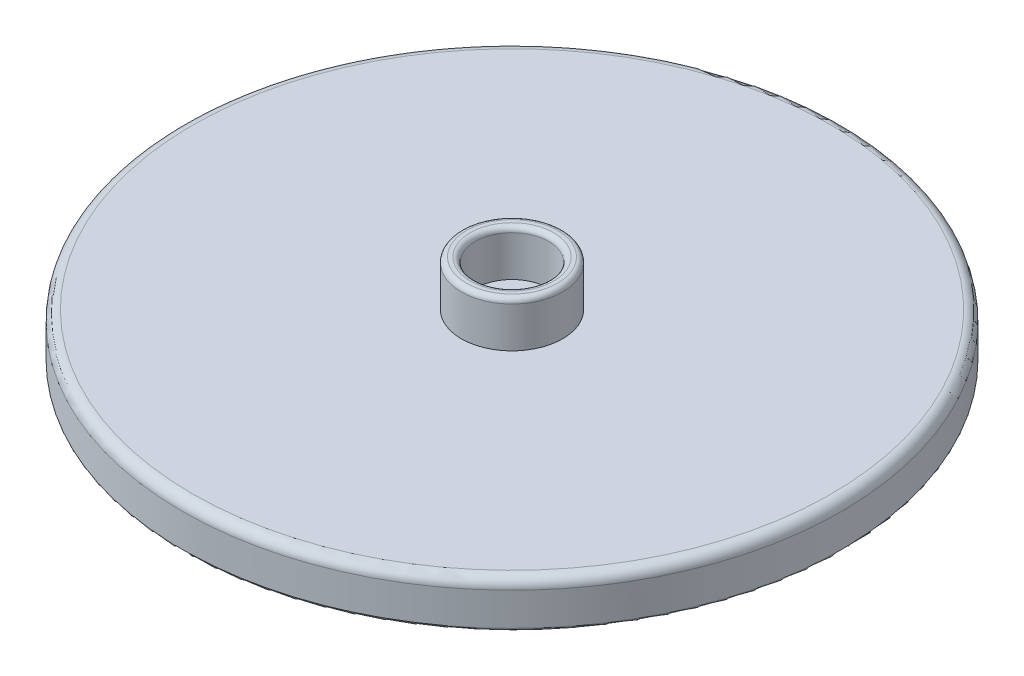
ISO-10303-21;
HEADER;
FILE_DESCRIPTION(('STEP AP214'),'2;1');
FILE_NAME('part.step','',(''),(''),'','','');
FILE_SCHEMA(('AUTOMOTIVE_DESIGN { 1 0 10303 214 1 1 1 1 }'));
ENDSEC;
DATA;
#1=APPLICATION_CONTEXT('core data for automotive mechanical design processes');
#2=APPLICATION_PROTOCOL_DEFINITION('international standard','automotive_design',2000,#1);
#3=PRODUCT_CONTEXT('',#1,'mechanical');
#4=PRODUCT('Part','Part','',(#3));
#5=PRODUCT_RELATED_PRODUCT_CATEGORY('part','',(#4));
#6=PRODUCT_DEFINITION_FORMATION('','',#4);
#7=PRODUCT_DEFINITION_CONTEXT('part definition',#1,'design');
#8=PRODUCT_DEFINITION('design','',#6,#7);
#9=PRODUCT_DEFINITION_SHAPE('','',#8);
#10=(LENGTH_UNIT() NAMED_UNIT(*) SI_UNIT(.MILLI.,.METRE.));
#11=(NAMED_UNIT(*) PLANE_ANGLE_UNIT() SI_UNIT($,.RADIAN.));
#12=(NAMED_UNIT(*) SI_UNIT($,.STERADIAN.) SOLID_ANGLE_UNIT());
#13=UNCERTAINTY_MEASURE_WITH_UNIT(LENGTH_MEASURE(1.E-05),#10,'distance_accuracy_value','');
#14=(GEOMETRIC_REPRESENTATION_CONTEXT(3) GLOBAL_UNCERTAINTY_ASSIGNED_CONTEXT((#13)) GLOBAL_UNIT_ASSIGNED_CONTEXT((#10,
#11,#12)) REPRESENTATION_CONTEXT('',''));
#15=CARTESIAN_POINT('',(0.,0.,0.));
#16=DIRECTION('',(0.,0.,1.));
#17=DIRECTION('',(1.,0.,0.));
#18=AXIS2_PLACEMENT_3D('',#15,#16,#17);
#19=CARTESIAN_POINT('',(54.1116652840397,0.,0.));
#20=DIRECTION('',(0.,1.,0.));
#21=DIRECTION('',(0.,0.,1.));
#22=AXIS2_PLACEMENT_3D('',#19,#20,#21);
#23=PLANE('',#22);
#24=CARTESIAN_POINT('',(-7.38833471596016,0.,-61.5));
#25=DIRECTION('',(0.,1.,0.));
#26=DIRECTION('',(0.,0.,1.));
#27=AXIS2_PLACEMENT_3D('',#24,#25,#26);
#28=CIRCLE('',#27,59.5);
#29=CARTESIAN_POINT('',(52.1116652840398,0.,-61.5000000000004));
#30=VERTEX_POINT('',#29);
#31=CARTESIAN_POINT('',(-7.38833471596058,0.,-2.));
#32=VERTEX_POINT('',#31);
#33=EDGE_CURVE('E240',#30,#32,#28,.F.);
#34=ORIENTED_EDGE('',*,*,#33,.T.);
#35=DIRECTION('',(-1.,0.,0.));
#36=VECTOR('',#35,1.);
#37=CARTESIAN_POINT('',(54.1116652840397,0.,-2.));
#38=LINE('',#37,#36);
#39=CARTESIAN_POINT('',(-10.3573195070984,0.,-2.));
#40=VERTEX_POINT('',#39);
#41=EDGE_CURVE('E242',#32,#40,#38,.T.);
#42=ORIENTED_EDGE('',*,*,#41,.T.);
#43=CARTESIAN_POINT('',(54.1116652840397,0.,0.));
#44=DIRECTION('',(0.,1.,0.));
#45=DIRECTION('',(0.,0.,1.));
#46=AXIS2_PLACEMENT_3D('',#43,#44,#45);
#47=CIRCLE('',#46,64.5);
#48=CARTESIAN_POINT('',(52.1116652840398,0.,-64.4689847911382));
#49=VERTEX_POINT('',#48);
#50=EDGE_CURVE('E236',#40,#49,#47,.F.);
#51=ORIENTED_EDGE('',*,*,#50,.T.);
#52=DIRECTION('',(0.,0.,-1.));
#53=VECTOR('',#52,1.);
#54=CARTESIAN_POINT('',(52.1116652840398,0.,0.));
#55=LINE('',#54,#53);
#56=EDGE_CURVE('E238',#49,#30,#55,.F.);
#57=ORIENTED_EDGE('',*,*,#56,.T.);
#58=EDGE_LOOP('',(#34,#42,#51,#57));
#59=FACE_BOUND('',#58,.T.);
#60=ADVANCED_FACE('F37',(#59),#23,.F.);
#61=CARTESIAN_POINT('',(-7.38833471596016,0.,61.5));
#62=DIRECTION('',(0.,1.,0.));
#63=DIRECTION('',(0.,0.,1.));
#64=AXIS2_PLACEMENT_3D('',#61,#62,#63);
#65=CIRCLE('',#64,59.5);
#66=CARTESIAN_POINT('',(-7.38833471596058,0.,2.));
#67=VERTEX_POINT('',#66);
#68=CARTESIAN_POINT('',(52.1116652840398,0.,61.5000000000004));
#69=VERTEX_POINT('',#68);
#70=EDGE_CURVE('E231',#67,#69,#65,.F.);
#71=ORIENTED_EDGE('',*,*,#70,.T.);
#72=DIRECTION('',(0.,0.,1.));
#73=VECTOR('',#72,1.);
#74=CARTESIAN_POINT('',(52.1116652840398,0.,0.));
#75=LINE('',#74,#73);
#76=CARTESIAN_POINT('',(52.1116652840398,0.,64.4689847911382));
#77=VERTEX_POINT('',#76);
#78=EDGE_CURVE('E233',#69,#77,#75,.T.);
#79=ORIENTED_EDGE('',*,*,#78,.T.);
#80=CARTESIAN_POINT('',(54.1116652840397,0.,0.));
#81=DIRECTION('',(0.,1.,0.));
#82=DIRECTION('',(0.,0.,1.));
#83=AXIS2_PLACEMENT_3D('',#80,#81,#82);
#84=CIRCLE('',#83,64.5);
#85=CARTESIAN_POINT('',(-10.3573195070984,0.,2.));
#86=VERTEX_POINT('',#85);
#87=EDGE_CURVE('E227',#77,#86,#84,.F.);
#88=ORIENTED_EDGE('',*,*,#87,.T.);
#89=DIRECTION('',(-1.,0.,0.));
#90=VECTOR('',#89,1.);
#91=CARTESIAN_POINT('',(54.1116652840397,0.,2.));
#92=LINE('',#91,#90);
#93=EDGE_CURVE('E229',#86,#67,#92,.F.);
#94=ORIENTED_EDGE('',*,*,#93,.T.);
#95=EDGE_LOOP('',(#71,#79,#88,#94));
#96=FACE_BOUND('',#95,.T.);
#97=ADVANCED_FACE('F420',(#96),#23,.F.);
#98=CARTESIAN_POINT('',(115.61166528404,0.,61.5));
#99=DIRECTION('',(0.,1.,0.));
#100=DIRECTION('',(0.,0.,1.));
#101=AXIS2_PLACEMENT_3D('',#98,#99,#100);
#102=CIRCLE('',#101,59.5);
#103=CARTESIAN_POINT('',(56.1116652840398,0.,61.5000000000004));
#104=VERTEX_POINT('',#103);
#105=CARTESIAN_POINT('',(115.61166528404,0.,2.));
#106=VERTEX_POINT('',#105);
#107=EDGE_CURVE('E214',#104,#106,#102,.F.);
#108=ORIENTED_EDGE('',*,*,#107,.T.);
#109=DIRECTION('',(1.,0.,0.));
#110=VECTOR('',#109,1.);
#111=CARTESIAN_POINT('',(54.1116652840397,0.,2.));
#112=LINE('',#111,#110);
#113=CARTESIAN_POINT('',(118.580650075178,0.,2.));
#114=VERTEX_POINT('',#113);
#115=EDGE_CURVE('E216',#106,#114,#112,.T.);
#116=ORIENTED_EDGE('',*,*,#115,.T.);
#117=CARTESIAN_POINT('',(54.1116652840397,0.,0.));
#118=DIRECTION('',(0.,1.,0.));
#119=DIRECTION('',(0.,0.,1.));
#120=AXIS2_PLACEMENT_3D('',#117,#118,#119);
#121=CIRCLE('',#120,64.5);
#122=CARTESIAN_POINT('',(56.1116652840398,0.,64.4689847911382));
#123=VERTEX_POINT('',#122);
#124=EDGE_CURVE('E210',#114,#123,#121,.F.);
#125=ORIENTED_EDGE('',*,*,#124,.T.);
#126=DIRECTION('',(0.,0.,1.));
#127=VECTOR('',#126,1.);
#128=CARTESIAN_POINT('',(56.1116652840398,0.,0.));
#129=LINE('',#128,#127);
#130=EDGE_CURVE('E212',#123,#104,#129,.F.);
#131=ORIENTED_EDGE('',*,*,#130,.T.);
#132=EDGE_LOOP('',(#108,#116,#125,#131));
#133=FACE_BOUND('',#132,.T.);
#134=ADVANCED_FACE('F427',(#133),#23,.F.);
#135=CARTESIAN_POINT('',(54.1116652840397,9.,0.));
#136=DIRECTION('',(0.,-1.,0.));
#137=DIRECTION('',(0.,0.,-1.));
#138=AXIS2_PLACEMENT_3D('',#135,#136,#137);
#139=CYLINDRICAL_SURFACE('',#138,65.);
#140=CARTESIAN_POINT('',(54.1116652840397,7.,0.));
#141=DIRECTION('',(0.,1.,0.));
#142=DIRECTION('',(0.,0.,1.));
#143=AXIS2_PLACEMENT_3D('',#140,#141,#142);
#144=CIRCLE('',#143,65.);
#145=CARTESIAN_POINT('',(54.1116652840397,7.,65.));
#146=VERTEX_POINT('',#145);
#147=EDGE_CURVE('E376',#146,#146,#144,.F.);
#148=ORIENTED_EDGE('',*,*,#147,.T.);
#149=EDGE_LOOP('',(#148));
#150=FACE_BOUND('',#149,.T.);
#151=CARTESIAN_POINT('',(54.1116652840397,0.5,0.));
#152=DIRECTION('',(0.,-1.,0.));
#153=DIRECTION('',(0.,0.,-1.));
#154=AXIS2_PLACEMENT_3D('',#151,#152,#153);
#155=CIRCLE('',#154,65.);
#156=CARTESIAN_POINT('',(55.6116652840398,0.5,64.9826900028));
#157=VERTEX_POINT('',#156);
#158=CARTESIAN_POINT('',(52.6116652840398,0.5,64.9826900028));
#159=VERTEX_POINT('',#158);
#160=EDGE_CURVE('E463',#157,#159,#155,.T.);
#161=ORIENTED_EDGE('',*,*,#160,.F.);
#162=CARTESIAN_POINT('',(54.1116652840397,0.5,0.));
#163=DIRECTION('',(0.,1.,0.));
#164=DIRECTION('',(0.,0.,1.));
#165=AXIS2_PLACEMENT_3D('',#162,#163,#164);
#166=CIRCLE('',#165,65.);
#167=CARTESIAN_POINT('',(119.09435528684,0.5,1.5));
#168=VERTEX_POINT('',#167);
#169=EDGE_CURVE('E225',#157,#168,#166,.T.);
#170=ORIENTED_EDGE('',*,*,#169,.T.);
#171=CARTESIAN_POINT('',(119.09435528684,0.5,-1.5));
#172=VERTEX_POINT('',#171);
#173=EDGE_CURVE('E209',#172,#168,#155,.T.);
#174=ORIENTED_EDGE('',*,*,#173,.F.);
#175=CARTESIAN_POINT('',(54.1116652840397,0.5,0.));
#176=DIRECTION('',(0.,1.,0.));
#177=DIRECTION('',(0.,0.,1.));
#178=AXIS2_PLACEMENT_3D('',#175,#176,#177);
#179=CIRCLE('',#178,65.);
#180=CARTESIAN_POINT('',(55.6116652840399,0.5,-64.9826900028));
#181=VERTEX_POINT('',#180);
#182=EDGE_CURVE('E219',#172,#181,#179,.T.);
#183=ORIENTED_EDGE('',*,*,#182,.T.);
#184=CARTESIAN_POINT('',(52.6116652840398,0.5,-64.9826900028));
#185=VERTEX_POINT('',#184);
#186=EDGE_CURVE('E206',#185,#181,#155,.T.);
#187=ORIENTED_EDGE('',*,*,#186,.F.);
#188=CARTESIAN_POINT('',(54.1116652840397,0.5,0.));
#189=DIRECTION('',(0.,1.,0.));
#190=DIRECTION('',(0.,0.,1.));
#191=AXIS2_PLACEMENT_3D('',#188,#189,#190);
#192=CIRCLE('',#191,65.);
#193=CARTESIAN_POINT('',(-10.8710247187603,0.5,-1.5));
#194=VERTEX_POINT('',#193);
#195=EDGE_CURVE('E221',#185,#194,#192,.T.);
#196=ORIENTED_EDGE('',*,*,#195,.T.);
#197=CARTESIAN_POINT('',(-10.8710247187603,0.5,1.5));
#198=VERTEX_POINT('',#197);
#199=EDGE_CURVE('E208',#198,#194,#155,.T.);
#200=ORIENTED_EDGE('',*,*,#199,.F.);
#201=CARTESIAN_POINT('',(54.1116652840397,0.5,0.));
#202=DIRECTION('',(0.,1.,0.));
#203=DIRECTION('',(0.,0.,1.));
#204=AXIS2_PLACEMENT_3D('',#201,#202,#203);
#205=CIRCLE('',#204,65.);
#206=EDGE_CURVE('E223',#198,#159,#205,.T.);
#207=ORIENTED_EDGE('',*,*,#206,.T.);
#208=EDGE_LOOP('',(#161,#170,#174,#183,#187,#196,#200,#207));
#209=FACE_BOUND('',#208,.T.);
#210=ADVANCED_FACE('F438',(#150,#209),#139,.T.);
#211=CARTESIAN_POINT('',(54.1116652840397,9.,0.));
#212=DIRECTION('',(0.,1.,0.));
#213=DIRECTION('',(0.,0.,1.));
#214=AXIS2_PLACEMENT_3D('',#211,#212,#213);
#215=PLANE('',#214);
#216=CARTESIAN_POINT('',(54.1116652840397,9.,0.));
#217=DIRECTION('',(0.,1.,0.));
#218=DIRECTION('',(0.,0.,1.));
#219=AXIS2_PLACEMENT_3D('',#216,#217,#218);
#220=CIRCLE('',#219,63.);
#221=CARTESIAN_POINT('',(54.1116652840397,9.,63.));
#222=VERTEX_POINT('',#221);
#223=EDGE_CURVE('E250',#222,#222,#220,.T.);
#224=ORIENTED_EDGE('',*,*,#223,.T.);
#225=EDGE_LOOP('',(#224));
#226=FACE_BOUND('',#225,.T.);
#227=CARTESIAN_POINT('',(54.1116652840397,9.,0.));
#228=DIRECTION('',(0.,1.,0.));
#229=DIRECTION('',(0.,0.,1.));
#230=AXIS2_PLACEMENT_3D('',#227,#228,#229);
#231=CIRCLE('',#230,9.99999999999999);
#232=CARTESIAN_POINT('',(54.1116652840397,9.,9.99999999999999));
#233=VERTEX_POINT('',#232);
#234=EDGE_CURVE('E203',#233,#233,#231,.T.);
#235=ORIENTED_EDGE('',*,*,#234,.F.);
#236=EDGE_LOOP('',(#235));
#237=FACE_BOUND('',#236,.T.);
#238=ADVANCED_FACE('F431',(#226,#237),#215,.T.);
#239=CARTESIAN_POINT('',(54.1116652840397,0.,0.));
#240=DIRECTION('',(0.,1.,0.));
#241=DIRECTION('',(0.,0.,1.));
#242=AXIS2_PLACEMENT_3D('',#239,#240,#241);
#243=CIRCLE('',#242,64.5);
#244=CARTESIAN_POINT('',(56.1116652840399,0.,-64.4689847911382));
#245=VERTEX_POINT('',#244);
#246=CARTESIAN_POINT('',(118.580650075178,0.,-2.));
#247=VERTEX_POINT('',#246);
#248=EDGE_CURVE('E52',#245,#247,#243,.F.);
#249=ORIENTED_EDGE('',*,*,#248,.T.);
#250=DIRECTION('',(1.,0.,0.));
#251=VECTOR('',#250,1.);
#252=CARTESIAN_POINT('',(54.1116652840397,0.,-2.));
#253=LINE('',#252,#251);
#254=CARTESIAN_POINT('',(115.61166528404,0.,-2.00000000000001));
#255=VERTEX_POINT('',#254);
#256=EDGE_CURVE('E248',#247,#255,#253,.F.);
#257=ORIENTED_EDGE('',*,*,#256,.T.);
#258=CARTESIAN_POINT('',(115.61166528404,0.,-61.5));
#259=DIRECTION('',(0.,1.,0.));
#260=DIRECTION('',(0.,0.,1.));
#261=AXIS2_PLACEMENT_3D('',#258,#259,#260);
#262=CIRCLE('',#261,59.5);
#263=CARTESIAN_POINT('',(56.1116652840399,0.,-61.5000000000004));
#264=VERTEX_POINT('',#263);
#265=EDGE_CURVE('E168',#255,#264,#262,.F.);
#266=ORIENTED_EDGE('',*,*,#265,.T.);
#267=DIRECTION('',(0.,0.,-1.));
#268=VECTOR('',#267,1.);
#269=CARTESIAN_POINT('',(56.1116652840399,0.,0.));
#270=LINE('',#269,#268);
#271=EDGE_CURVE('E57',#264,#245,#270,.T.);
#272=ORIENTED_EDGE('',*,*,#271,.T.);
#273=EDGE_LOOP('',(#249,#257,#266,#272));
#274=FACE_BOUND('',#273,.T.);
#275=ADVANCED_FACE('F423',(#274),#23,.F.);
#276=CARTESIAN_POINT('',(54.1116652840397,18.,0.));
#277=DIRECTION('',(0.,-1.,0.));
#278=DIRECTION('',(0.,0.,-1.));
#279=AXIS2_PLACEMENT_3D('',#276,#277,#278);
#280=CYLINDRICAL_SURFACE('',#279,9.99999999999999);
#281=CARTESIAN_POINT('',(54.1116652840397,17.,0.));
#282=DIRECTION('',(0.,1.,0.));
#283=DIRECTION('',(0.,0.,1.));
#284=AXIS2_PLACEMENT_3D('',#281,#282,#283);
#285=CIRCLE('',#284,9.99999999999999);
#286=CARTESIAN_POINT('',(54.1116652840397,17.,9.99999999999999));
#287=VERTEX_POINT('',#286);
#288=EDGE_CURVE('E45',#287,#287,#285,.F.);
#289=ORIENTED_EDGE('',*,*,#288,.T.);
#290=EDGE_LOOP('',(#289));
#291=FACE_BOUND('',#290,.T.);
#292=ORIENTED_EDGE('',*,*,#234,.T.);
#293=EDGE_LOOP('',(#292));
#294=FACE_BOUND('',#293,.T.);
#295=ADVANCED_FACE('F387',(#291,#294),#280,.T.);
#296=CARTESIAN_POINT('',(54.1116652840397,18.,0.));
#297=DIRECTION('',(0.,1.,0.));
#298=DIRECTION('',(0.,0.,1.));
#299=AXIS2_PLACEMENT_3D('',#296,#297,#298);
#300=PLANE('',#299);
#301=CARTESIAN_POINT('',(54.1116652840397,18.,0.));
#302=DIRECTION('',(0.,1.,0.));
#303=DIRECTION('',(0.,0.,1.));
#304=AXIS2_PLACEMENT_3D('',#301,#302,#303);
#305=CIRCLE('',#304,8.99999999999999);
#306=CARTESIAN_POINT('',(54.1116652840397,18.,8.99999999999999));
#307=VERTEX_POINT('',#306);
#308=EDGE_CURVE('E382',#307,#307,#305,.T.);
#309=ORIENTED_EDGE('',*,*,#308,.T.);
#310=EDGE_LOOP('',(#309));
#311=FACE_BOUND('',#310,.T.);
#312=CARTESIAN_POINT('',(54.1116652840397,18.,0.));
#313=DIRECTION('',(0.,1.,0.));
#314=DIRECTION('',(0.,0.,1.));
#315=AXIS2_PLACEMENT_3D('',#312,#313,#314);
#316=CIRCLE('',#315,8.25);
#317=CARTESIAN_POINT('',(54.1116652840397,18.,8.25));
#318=VERTEX_POINT('',#317);
#319=EDGE_CURVE('E379',#318,#318,#316,.F.);
#320=ORIENTED_EDGE('',*,*,#319,.T.);
#321=EDGE_LOOP('',(#320));
#322=FACE_BOUND('',#321,.T.);
#323=ADVANCED_FACE('F395',(#311,#322),#300,.T.);
#324=CARTESIAN_POINT('',(54.1116652840397,9.,0.));
#325=DIRECTION('',(0.,1.,0.));
#326=DIRECTION('',(0.,0.,1.));
#327=AXIS2_PLACEMENT_3D('',#324,#325,#326);
#328=CYLINDRICAL_SURFACE('',#327,7.25);
#329=CARTESIAN_POINT('',(54.1116652840397,17.,0.));
#330=DIRECTION('',(0.,1.,0.));
#331=DIRECTION('',(0.,0.,1.));
#332=AXIS2_PLACEMENT_3D('',#329,#330,#331);
#333=CIRCLE('',#332,7.25);
#334=CARTESIAN_POINT('',(54.1116652840397,17.,7.25));
#335=VERTEX_POINT('',#334);
#336=EDGE_CURVE('E11',#335,#335,#333,.T.);
#337=ORIENTED_EDGE('',*,*,#336,.T.);
#338=EDGE_LOOP('',(#337));
#339=FACE_BOUND('',#338,.T.);
#340=CARTESIAN_POINT('',(54.1116652840397,9.,0.));
#341=DIRECTION('',(0.,1.,0.));
#342=DIRECTION('',(0.,0.,1.));
#343=AXIS2_PLACEMENT_3D('',#340,#341,#342);
#344=CIRCLE('',#343,7.25);
#345=CARTESIAN_POINT('',(54.1116652840397,9.,7.25));
#346=VERTEX_POINT('',#345);
#347=EDGE_CURVE('E200',#346,#346,#344,.T.);
#348=ORIENTED_EDGE('',*,*,#347,.F.);
#349=EDGE_LOOP('',(#348));
#350=FACE_BOUND('',#349,.T.);
#351=ADVANCED_FACE('F398',(#339,#350),#328,.F.);
#352=CARTESIAN_POINT('',(54.1116652840397,9.,0.));
#353=DIRECTION('',(0.,1.,0.));
#354=DIRECTION('',(0.,0.,1.));
#355=AXIS2_PLACEMENT_3D('',#352,#353,#354);
#356=PLANE('',#355);
#357=ORIENTED_EDGE('',*,*,#347,.T.);
#358=EDGE_LOOP('',(#357));
#359=FACE_BOUND('',#358,.T.);
#360=ADVANCED_FACE('F408',(#359),#356,.T.);
#361=CARTESIAN_POINT('',(115.61166528404,0.5,-61.5));
#362=DIRECTION('',(0.,-1.,0.));
#363=DIRECTION('',(0.,0.,-1.));
#364=AXIS2_PLACEMENT_3D('',#361,#362,#363);
#365=PLANE('',#364);
#366=ORIENTED_EDGE('',*,*,#173,.T.);
#367=DIRECTION('',(-1.,0.,0.));
#368=VECTOR('',#367,1.);
#369=CARTESIAN_POINT('',(115.61166528404,0.5,1.5));
#370=LINE('',#369,#368);
#371=CARTESIAN_POINT('',(115.61166528404,0.5,1.5));
#372=VERTEX_POINT('',#371);
#373=EDGE_CURVE('E176',#168,#372,#370,.T.);
#374=ORIENTED_EDGE('',*,*,#373,.T.);
#375=CARTESIAN_POINT('',(115.61166528404,0.5,61.5));
#376=DIRECTION('',(0.,1.,0.));
#377=DIRECTION('',(0.,0.,1.));
#378=AXIS2_PLACEMENT_3D('',#375,#376,#377);
#379=CIRCLE('',#378,60.);
#380=CARTESIAN_POINT('',(55.6116652840398,0.5,61.5000000000004));
#381=VERTEX_POINT('',#380);
#382=EDGE_CURVE('E179',#372,#381,#379,.T.);
#383=ORIENTED_EDGE('',*,*,#382,.T.);
#384=DIRECTION('',(0.,0.,1.));
#385=VECTOR('',#384,1.);
#386=CARTESIAN_POINT('',(55.6116652840398,0.5,70.1349630965501));
#387=LINE('',#386,#385);
#388=EDGE_CURVE('E183',#381,#157,#387,.T.);
#389=ORIENTED_EDGE('',*,*,#388,.T.);
#390=ORIENTED_EDGE('',*,*,#160,.T.);
#391=DIRECTION('',(0.,0.,-1.));
#392=VECTOR('',#391,1.);
#393=CARTESIAN_POINT('',(52.6116652840398,0.5,70.1349630965501));
#394=LINE('',#393,#392);
#395=CARTESIAN_POINT('',(52.6116652840398,0.5,61.5000000000004));
#396=VERTEX_POINT('',#395);
#397=EDGE_CURVE('E185',#159,#396,#394,.T.);
#398=ORIENTED_EDGE('',*,*,#397,.T.);
#399=CARTESIAN_POINT('',(-7.38833471596016,0.5,61.5));
#400=DIRECTION('',(0.,1.,0.));
#401=DIRECTION('',(0.,0.,-1.));
#402=AXIS2_PLACEMENT_3D('',#399,#400,#401);
#403=CIRCLE('',#402,60.);
#404=CARTESIAN_POINT('',(-7.38833471596058,0.5,1.50000000000001));
#405=VERTEX_POINT('',#404);
#406=EDGE_CURVE('E188',#396,#405,#403,.T.);
#407=ORIENTED_EDGE('',*,*,#406,.T.);
#408=DIRECTION('',(-1.,0.,0.));
#409=VECTOR('',#408,1.);
#410=CARTESIAN_POINT('',(-21.3999133820925,0.5,1.5));
#411=LINE('',#410,#409);
#412=EDGE_CURVE('E190',#405,#198,#411,.T.);
#413=ORIENTED_EDGE('',*,*,#412,.T.);
#414=ORIENTED_EDGE('',*,*,#199,.T.);
#415=DIRECTION('',(1.,0.,0.));
#416=VECTOR('',#415,1.);
#417=CARTESIAN_POINT('',(-21.3999133820925,0.5,-1.5));
#418=LINE('',#417,#416);
#419=CARTESIAN_POINT('',(-7.38833471596058,0.5,-1.5));
#420=VERTEX_POINT('',#419);
#421=EDGE_CURVE('E192',#194,#420,#418,.T.);
#422=ORIENTED_EDGE('',*,*,#421,.T.);
#423=CARTESIAN_POINT('',(-7.38833471596016,0.5,-61.5));
#424=DIRECTION('',(0.,1.,0.));
#425=DIRECTION('',(0.,0.,1.));
#426=AXIS2_PLACEMENT_3D('',#423,#424,#425);
#427=CIRCLE('',#426,60.);
#428=CARTESIAN_POINT('',(52.6116652840398,0.5,-61.5000000000004));
#429=VERTEX_POINT('',#428);
#430=EDGE_CURVE('E195',#420,#429,#427,.T.);
#431=ORIENTED_EDGE('',*,*,#430,.T.);
#432=DIRECTION('',(0.,0.,-1.));
#433=VECTOR('',#432,1.);
#434=CARTESIAN_POINT('',(52.6116652840398,0.5,-61.5000000000004));
#435=LINE('',#434,#433);
#436=EDGE_CURVE('E197',#429,#185,#435,.T.);
#437=ORIENTED_EDGE('',*,*,#436,.T.);
#438=ORIENTED_EDGE('',*,*,#186,.T.);
#439=DIRECTION('',(0.,0.,1.));
#440=VECTOR('',#439,1.);
#441=CARTESIAN_POINT('',(55.6116652840399,0.5,-61.5000000000004));
#442=LINE('',#441,#440);
#443=CARTESIAN_POINT('',(55.6116652840399,0.5,-61.5000000000004));
#444=VERTEX_POINT('',#443);
#445=EDGE_CURVE('E159',#181,#444,#442,.T.);
#446=ORIENTED_EDGE('',*,*,#445,.T.);
#447=CARTESIAN_POINT('',(115.61166528404,0.5,-61.5));
#448=DIRECTION('',(0.,1.,0.));
#449=DIRECTION('',(0.,0.,-1.));
#450=AXIS2_PLACEMENT_3D('',#447,#448,#449);
#451=CIRCLE('',#450,60.);
#452=CARTESIAN_POINT('',(115.61166528404,0.5,-1.5));
#453=VERTEX_POINT('',#452);
#454=EDGE_CURVE('E150',#444,#453,#451,.T.);
#455=ORIENTED_EDGE('',*,*,#454,.T.);
#456=DIRECTION('',(1.,0.,0.));
#457=VECTOR('',#456,1.);
#458=CARTESIAN_POINT('',(115.61166528404,0.5,-1.5));
#459=LINE('',#458,#457);
#460=EDGE_CURVE('E155',#453,#172,#459,.T.);
#461=ORIENTED_EDGE('',*,*,#460,.T.);
#462=EDGE_LOOP('',(#366,#374,#383,#389,#390,#398,#407,#413,#414,#422,#431,#437,#438,#446,#455,#461));
#463=FACE_BOUND('',#462,.T.);
#464=ADVANCED_FACE('F153',(#463),#365,.T.);
#465=CARTESIAN_POINT('',(56.1116652840398,0.5,70.1349630965501));
#466=DIRECTION('',(0.,0.,1.));
#467=DIRECTION('',(1.,0.,0.));
#468=AXIS2_PLACEMENT_3D('',#465,#466,#467);
#469=CYLINDRICAL_SURFACE('',#468,0.5);
#470=CARTESIAN_POINT('',(55.6116652840398,0.5,64.9826900028));
#471=CARTESIAN_POINT('',(55.6116272572047,0.477708433560287,64.9827287367512));
#472=CARTESIAN_POINT('',(55.6131533505037,0.455475352357971,64.9811671967227));
#473=CARTESIAN_POINT('',(55.6190012359249,0.411971257155694,64.9751824406726));
#474=CARTESIAN_POINT('',(55.6232980166419,0.390693440074029,64.9707848262684));
#475=CARTESIAN_POINT('',(55.6343493832726,0.34958362930897,64.9594723225006));
#476=CARTESIAN_POINT('',(55.6410969443972,0.329747695786037,64.9525646278747));
#477=CARTESIAN_POINT('',(55.656631551503,0.291754210124148,64.9366579859223));
#478=CARTESIAN_POINT('',(55.6654233101326,0.273600673902891,64.9276542062669));
#479=CARTESIAN_POINT('',(55.6886528334179,0.231965441894547,64.9038585043066));
#480=CARTESIAN_POINT('',(55.7039145695207,0.20942801672683,64.8882202411205));
#481=CARTESIAN_POINT('',(55.7367442847463,0.168137249327894,64.8545663633267));
#482=CARTESIAN_POINT('',(55.7543166996409,0.149391365950273,64.836546175822));
#483=CARTESIAN_POINT('',(55.7984650395603,0.108674750910419,64.791251937733));
#484=CARTESIAN_POINT('',(55.8258170793939,0.088445175512808,64.7631735677325));
#485=CARTESIAN_POINT('',(55.8823724862446,0.0544493747627465,64.7050754614535));
#486=CARTESIAN_POINT('',(55.9115781550557,0.0406913712060574,64.6750533104643));
#487=CARTESIAN_POINT('',(55.9686400396368,0.0200108626207813,64.6163535848261));
#488=CARTESIAN_POINT('',(55.9964196924622,0.0126329401421056,64.587758090805));
#489=CARTESIAN_POINT('',(56.0523272685095,0.00272470351059184,64.5301695548097));
#490=CARTESIAN_POINT('',(56.0804543659422,0.000184533970389786,64.5011774425129));
#491=CARTESIAN_POINT('',(56.1095895601741,3.23627423247217E-06,64.4711258815913));
#492=CARTESIAN_POINT('',(56.1106274483007,5.36382343863231E-09,64.4700553227661));
#493=CARTESIAN_POINT('',(56.1116652840398,0.,64.4689847911382));
#494=B_SPLINE_CURVE_WITH_KNOTS('',3,(#470,#471,#472,#473,#474,#475,#476,#477,#478,#479,#480,
#481,#482,#483,#484,#485,#486,#487,#488,#489,#490,#491,#492,#493),.UNSPECIFIED.,.F.,.F.,(4,2,2,
2,2,2,2,2,2,2,2,4),(0.,0.0666752702236213,0.132756922601496,0.198650637765958,0.264697796045167,
0.358349868675154,0.452184422398403,0.583804835502154,0.715592016860467,0.836931887488882,
0.95802430108999,0.962497523165904),.UNSPECIFIED.);
#495=EDGE_CURVE('E275',#157,#123,#494,.T.);
#496=ORIENTED_EDGE('',*,*,#495,.F.);
#497=ORIENTED_EDGE('',*,*,#388,.F.);
#498=CARTESIAN_POINT('',(56.1116652840398,0.5,61.5000000000004));
#499=DIRECTION('',(0.,0.,-1.));
#500=DIRECTION('',(-1.,0.,0.));
#501=AXIS2_PLACEMENT_3D('',#498,#499,#500);
#502=CIRCLE('',#501,0.5);
#503=EDGE_CURVE('E163',#104,#381,#502,.T.);
#504=ORIENTED_EDGE('',*,*,#503,.F.);
#505=ORIENTED_EDGE('',*,*,#130,.F.);
#506=EDGE_LOOP('',(#496,#497,#504,#505));
#507=FACE_BOUND('',#506,.T.);
#508=ADVANCED_FACE('F271',(#507),#469,.T.);
#509=CARTESIAN_POINT('',(115.61166528404,0.5,61.5));
#510=DIRECTION('',(0.,1.,0.));
#511=DIRECTION('',(0.,0.,1.));
#512=AXIS2_PLACEMENT_3D('',#509,#510,#511);
#513=TOROIDAL_SURFACE('',#512,59.5,0.5);
#514=ORIENTED_EDGE('',*,*,#503,.T.);
#515=ORIENTED_EDGE('',*,*,#382,.F.);
#516=CARTESIAN_POINT('',(115.61166528404,0.5,2.));
#517=DIRECTION('',(1.,0.,0.));
#518=DIRECTION('',(0.,0.,-1.));
#519=AXIS2_PLACEMENT_3D('',#516,#517,#518);
#520=CIRCLE('',#519,0.5);
#521=EDGE_CURVE('E259',#106,#372,#520,.T.);
#522=ORIENTED_EDGE('',*,*,#521,.F.);
#523=ORIENTED_EDGE('',*,*,#107,.F.);
#524=EDGE_LOOP('',(#514,#515,#522,#523));
#525=FACE_BOUND('',#524,.T.);
#526=ADVANCED_FACE('F269',(#525),#513,.T.);
#527=CARTESIAN_POINT('',(54.1116652840397,0.5,0.));
#528=DIRECTION('',(0.,1.,0.));
#529=DIRECTION('',(0.,0.,1.));
#530=AXIS2_PLACEMENT_3D('',#527,#528,#529);
#531=TOROIDAL_SURFACE('',#530,64.5,0.5);
#532=ORIENTED_EDGE('',*,*,#495,.T.);
#533=ORIENTED_EDGE('',*,*,#124,.F.);
#534=CARTESIAN_POINT('',(119.09435528684,0.5,1.5));
#535=CARTESIAN_POINT('',(119.094394020791,0.47770843356029,1.49996197316483));
#536=CARTESIAN_POINT('',(119.092832480762,0.455475352357973,1.50148806646389));
#537=CARTESIAN_POINT('',(119.086847724712,0.411971257155695,1.50733595188503));
#538=CARTESIAN_POINT('',(119.082450110308,0.390693440074029,1.51163273260203));
#539=CARTESIAN_POINT('',(119.07113760654,0.349583629308973,1.52268409923277));
#540=CARTESIAN_POINT('',(119.064229911914,0.329747695786043,1.52943166035739));
#541=CARTESIAN_POINT('',(119.048323269962,0.291754210124157,1.54496626746321));
#542=CARTESIAN_POINT('',(119.039319490307,0.273600673902898,1.55375802609274));
#543=CARTESIAN_POINT('',(119.015523788346,0.23196544189455,1.57698754937801));
#544=CARTESIAN_POINT('',(118.99988552516,0.209428016726833,1.59224928548088));
#545=CARTESIAN_POINT('',(118.966231647366,0.168137249327897,1.62507900070651));
#546=CARTESIAN_POINT('',(118.948211459862,0.149391365950276,1.64265141560101));
#547=CARTESIAN_POINT('',(118.902917221773,0.10867475091042,1.68679975552045));
#548=CARTESIAN_POINT('',(118.874838851772,0.0884451755128091,1.71415179535402));
#549=CARTESIAN_POINT('',(118.816740745493,0.0544493747627457,1.77070720220481));
#550=CARTESIAN_POINT('',(118.786718594504,0.0406913712060547,1.79991287101592));
#551=CARTESIAN_POINT('',(118.728018868866,0.0200108626207787,1.85697475559697));
#552=CARTESIAN_POINT('',(118.699423374845,0.0126329401421045,1.88475440842234));
#553=CARTESIAN_POINT('',(118.641834838849,0.00272470351059172,1.94066198446963));
#554=CARTESIAN_POINT('',(118.612842726553,0.000184533970389136,1.96878908190242));
#555=CARTESIAN_POINT('',(118.582791165631,3.23627423242712E-06,1.9979242761343));
#556=CARTESIAN_POINT('',(118.581720606806,5.36382341658723E-09,1.9989621642609));
#557=CARTESIAN_POINT('',(118.580650075178,0.,2.));
#558=B_SPLINE_CURVE_WITH_KNOTS('',3,(#534,#535,#536,#537,#538,#539,#540,#541,#542,#543,#544,
#545,#546,#547,#548,#549,#550,#551,#552,#553,#554,#555,#556,#557),.UNSPECIFIED.,.F.,.F.,(4,2,2,
2,2,2,2,2,2,2,2,4),(0.,0.0666752702236199,0.132756922601492,0.198650637765951,0.264697796045162,
0.358349868675155,0.4521844223984,0.583804835502154,0.715592016860474,0.836931887488886,
0.958024301089994,0.962497523165906),.UNSPECIFIED.);
#559=EDGE_CURVE('E251',#168,#114,#558,.T.);
#560=ORIENTED_EDGE('',*,*,#559,.F.);
#561=ORIENTED_EDGE('',*,*,#169,.F.);
#562=EDGE_LOOP('',(#532,#533,#560,#561));
#563=FACE_BOUND('',#562,.T.);
#564=ADVANCED_FACE('F265',(#563),#531,.T.);
#565=CARTESIAN_POINT('',(54.1116652840397,0.5,2.));
#566=DIRECTION('',(1.,0.,0.));
#567=DIRECTION('',(0.,0.,-1.));
#568=AXIS2_PLACEMENT_3D('',#565,#566,#567);
#569=CYLINDRICAL_SURFACE('',#568,0.5);
#570=ORIENTED_EDGE('',*,*,#521,.T.);
#571=ORIENTED_EDGE('',*,*,#373,.F.);
#572=ORIENTED_EDGE('',*,*,#559,.T.);
#573=ORIENTED_EDGE('',*,*,#115,.F.);
#574=EDGE_LOOP('',(#570,#571,#572,#573));
#575=FACE_BOUND('',#574,.T.);
#576=ADVANCED_FACE('F262',(#575),#569,.T.);
#577=CARTESIAN_POINT('',(-21.3999133820925,0.5,2.));
#578=DIRECTION('',(-1.,0.,0.));
#579=DIRECTION('',(0.,0.,1.));
#580=AXIS2_PLACEMENT_3D('',#577,#578,#579);
#581=CYLINDRICAL_SURFACE('',#580,0.5);
#582=CARTESIAN_POINT('',(-10.8710247187603,0.5,1.5));
#583=CARTESIAN_POINT('',(-10.8710634527115,0.47770843356029,1.49996197316483));
#584=CARTESIAN_POINT('',(-10.8695019126829,0.455475352357973,1.50148806646389));
#585=CARTESIAN_POINT('',(-10.8635171566329,0.411971257155695,1.50733595188503));
#586=CARTESIAN_POINT('',(-10.8591195422287,0.39069344007403,1.51163273260203));
#587=CARTESIAN_POINT('',(-10.8478070384609,0.349583629308971,1.52268409923277));
#588=CARTESIAN_POINT('',(-10.840899343835,0.329747695786039,1.52943166035739));
#589=CARTESIAN_POINT('',(-10.8249927018826,0.291754210124152,1.54496626746321));
#590=CARTESIAN_POINT('',(-10.8159889222272,0.273600673902894,1.55375802609274));
#591=CARTESIAN_POINT('',(-10.7921932202669,0.231965441894549,1.57698754937801));
#592=CARTESIAN_POINT('',(-10.7765549570808,0.209428016726832,1.59224928548088));
#593=CARTESIAN_POINT('',(-10.742901079287,0.168137249327895,1.62507900070651));
#594=CARTESIAN_POINT('',(-10.7248808917823,0.149391365950272,1.64265141560102));
#595=CARTESIAN_POINT('',(-10.6795866536933,0.108674750910417,1.68679975552045));
#596=CARTESIAN_POINT('',(-10.6515082836927,0.0884451755128089,1.71415179535402));
#597=CARTESIAN_POINT('',(-10.5934101774138,0.0544493747627478,1.7707072022048));
#598=CARTESIAN_POINT('',(-10.5633880264246,0.0406913712060551,1.79991287101591));
#599=CARTESIAN_POINT('',(-10.5046883007864,0.0200108626207784,1.85697475559697));
#600=CARTESIAN_POINT('',(-10.4760928067653,0.0126329401421054,1.88475440842235));
#601=CARTESIAN_POINT('',(-10.41850427077,0.00272470351059271,1.94066198446961));
#602=CARTESIAN_POINT('',(-10.3895121584732,0.000184533970388745,1.96878908190238));
#603=CARTESIAN_POINT('',(-10.3594605975516,3.23627423239329E-06,1.9979242761343));
#604=CARTESIAN_POINT('',(-10.3583900387263,5.36382339786752E-09,1.9989621642609));
#605=CARTESIAN_POINT('',(-10.3573195070984,0.,2.));
#606=B_SPLINE_CURVE_WITH_KNOTS('',3,(#582,#583,#584,#585,#586,#587,#588,#589,#590,#591,#592,
#593,#594,#595,#596,#597,#598,#599,#600,#601,#602,#603,#604,#605),.UNSPECIFIED.,.F.,.F.,(4,2,2,
2,2,2,2,2,2,2,2,4),(0.,0.0666752702236201,0.132756922601492,0.198650637765956,0.264697796045163,
0.358349868675155,0.452184422398397,0.583804835502157,0.715592016860471,0.836931887488888,
0.958024301089989,0.962497523165902),.UNSPECIFIED.);
#607=EDGE_CURVE('E307',#198,#86,#606,.T.);
#608=ORIENTED_EDGE('',*,*,#607,.F.);
#609=ORIENTED_EDGE('',*,*,#412,.F.);
#610=CARTESIAN_POINT('',(-7.38833471596058,0.5,2.));
#611=DIRECTION('',(1.,0.,0.));
#612=DIRECTION('',(0.,0.,-1.));
#613=AXIS2_PLACEMENT_3D('',#610,#611,#612);
#614=CIRCLE('',#613,0.5);
#615=EDGE_CURVE('E260',#67,#405,#614,.T.);
#616=ORIENTED_EDGE('',*,*,#615,.F.);
#617=ORIENTED_EDGE('',*,*,#93,.F.);
#618=EDGE_LOOP('',(#608,#609,#616,#617));
#619=FACE_BOUND('',#618,.T.);
#620=ADVANCED_FACE('F303',(#619),#581,.T.);
#621=CARTESIAN_POINT('',(-7.38833471596016,0.5,61.5));
#622=DIRECTION('',(0.,1.,0.));
#623=DIRECTION('',(0.,0.,1.));
#624=AXIS2_PLACEMENT_3D('',#621,#622,#623);
#625=TOROIDAL_SURFACE('',#624,59.5,0.5);
#626=ORIENTED_EDGE('',*,*,#615,.T.);
#627=ORIENTED_EDGE('',*,*,#406,.F.);
#628=CARTESIAN_POINT('',(52.1116652840398,0.5,61.5000000000004));
#629=DIRECTION('',(0.,0.,1.));
#630=DIRECTION('',(1.,0.,0.));
#631=AXIS2_PLACEMENT_3D('',#628,#629,#630);
#632=CIRCLE('',#631,0.5);
#633=EDGE_CURVE('E292',#69,#396,#632,.T.);
#634=ORIENTED_EDGE('',*,*,#633,.F.);
#635=ORIENTED_EDGE('',*,*,#70,.F.);
#636=EDGE_LOOP('',(#626,#627,#634,#635));
#637=FACE_BOUND('',#636,.T.);
#638=ADVANCED_FACE('F301',(#637),#625,.T.);
#639=CARTESIAN_POINT('',(54.1116652840397,0.5,0.));
#640=DIRECTION('',(0.,1.,0.));
#641=DIRECTION('',(0.,0.,1.));
#642=AXIS2_PLACEMENT_3D('',#639,#640,#641);
#643=TOROIDAL_SURFACE('',#642,64.5,0.5);
#644=ORIENTED_EDGE('',*,*,#607,.T.);
#645=ORIENTED_EDGE('',*,*,#87,.F.);
#646=CARTESIAN_POINT('',(52.6116652840398,0.5,64.9826900028));
#647=CARTESIAN_POINT('',(52.611703310875,0.47770843356029,64.9827287367512));
#648=CARTESIAN_POINT('',(52.6101772175759,0.455475352357973,64.9811671967227));
#649=CARTESIAN_POINT('',(52.6043293321548,0.411971257155694,64.9751824406726));
#650=CARTESIAN_POINT('',(52.6000325514378,0.390693440074029,64.9707848262684));
#651=CARTESIAN_POINT('',(52.5889811848071,0.349583629308972,64.9594723225007));
#652=CARTESIAN_POINT('',(52.5822336236824,0.329747695786041,64.9525646278747));
#653=CARTESIAN_POINT('',(52.5666990165766,0.291754210124155,64.9366579859223));
#654=CARTESIAN_POINT('',(52.5579072579471,0.273600673902896,64.9276542062669));
#655=CARTESIAN_POINT('',(52.5346777346618,0.231965441894551,64.9038585043066));
#656=CARTESIAN_POINT('',(52.5194159985589,0.209428016726837,64.8882202411205));
#657=CARTESIAN_POINT('',(52.4865862833333,0.168137249327902,64.8545663633267));
#658=CARTESIAN_POINT('',(52.4690138684388,0.149391365950278,64.836546175822));
#659=CARTESIAN_POINT('',(52.4248655285194,0.108674750910421,64.791251937733));
#660=CARTESIAN_POINT('',(52.3975134886858,0.0884451755128131,64.7631735677325));
#661=CARTESIAN_POINT('',(52.340958081835,0.0544493747627532,64.7050754614536));
#662=CARTESIAN_POINT('',(52.3117524130239,0.0406913712060604,64.6750533104643));
#663=CARTESIAN_POINT('',(52.2546905284429,0.0200108626207805,64.6163535848261));
#664=CARTESIAN_POINT('',(52.2269108756175,0.0126329401421059,64.587758090805));
#665=CARTESIAN_POINT('',(52.1710032995702,0.00272470351059215,64.5301695548097));
#666=CARTESIAN_POINT('',(52.1428762021375,0.000184533970388435,64.5011774425129));
#667=CARTESIAN_POINT('',(52.1137410079055,3.23627423238596E-06,64.4711258815913));
#668=CARTESIAN_POINT('',(52.1127031197789,5.36382340088779E-09,64.470055322766));
#669=CARTESIAN_POINT('',(52.1116652840398,0.,64.4689847911382));
#670=B_SPLINE_CURVE_WITH_KNOTS('',3,(#646,#647,#648,#649,#650,#651,#652,#653,#654,#655,#656,
#657,#658,#659,#660,#661,#662,#663,#664,#665,#666,#667,#668,#669),.UNSPECIFIED.,.F.,.F.,(4,2,2,
2,2,2,2,2,2,2,2,4),(0.,0.0666752702236205,0.132756922601492,0.198650637765955,0.264697796045161,
0.358349868675151,0.452184422398389,0.583804835502149,0.715592016860444,0.836931887488884,
0.958024301090002,0.962497523165906),.UNSPECIFIED.);
#671=EDGE_CURVE('E284',#159,#77,#670,.T.);
#672=ORIENTED_EDGE('',*,*,#671,.F.);
#673=ORIENTED_EDGE('',*,*,#206,.F.);
#674=EDGE_LOOP('',(#644,#645,#672,#673));
#675=FACE_BOUND('',#674,.T.);
#676=ADVANCED_FACE('F297',(#675),#643,.T.);
#677=CARTESIAN_POINT('',(52.1116652840398,0.5,0.));
#678=DIRECTION('',(0.,0.,1.));
#679=DIRECTION('',(1.,0.,0.));
#680=AXIS2_PLACEMENT_3D('',#677,#678,#679);
#681=CYLINDRICAL_SURFACE('',#680,0.5);
#682=ORIENTED_EDGE('',*,*,#633,.T.);
#683=ORIENTED_EDGE('',*,*,#397,.F.);
#684=ORIENTED_EDGE('',*,*,#671,.T.);
#685=ORIENTED_EDGE('',*,*,#78,.F.);
#686=EDGE_LOOP('',(#682,#683,#684,#685));
#687=FACE_BOUND('',#686,.T.);
#688=ADVANCED_FACE('F295',(#687),#681,.T.);
#689=CARTESIAN_POINT('',(52.1116652840398,0.5,-61.5000000000004));
#690=DIRECTION('',(0.,0.,-1.));
#691=DIRECTION('',(-1.,0.,0.));
#692=AXIS2_PLACEMENT_3D('',#689,#690,#691);
#693=CYLINDRICAL_SURFACE('',#692,0.5);
#694=CARTESIAN_POINT('',(52.6116652840398,0.5,-64.9826900028));
#695=CARTESIAN_POINT('',(52.611703310875,0.477708433560291,-64.9827287367512));
#696=CARTESIAN_POINT('',(52.6101772175759,0.455475352357973,-64.9811671967227));
#697=CARTESIAN_POINT('',(52.6043293321548,0.411971257155695,-64.9751824406726));
#698=CARTESIAN_POINT('',(52.6000325514378,0.390693440074029,-64.9707848262684));
#699=CARTESIAN_POINT('',(52.5889811848071,0.349583629308972,-64.9594723225007));
#700=CARTESIAN_POINT('',(52.5822336236825,0.329747695786041,-64.9525646278747));
#701=CARTESIAN_POINT('',(52.5666990165766,0.291754210124155,-64.9366579859223));
#702=CARTESIAN_POINT('',(52.5579072579471,0.273600673902896,-64.9276542062669));
#703=CARTESIAN_POINT('',(52.5346777346618,0.231965441894551,-64.9038585043066));
#704=CARTESIAN_POINT('',(52.519415998559,0.209428016726837,-64.8882202411205));
#705=CARTESIAN_POINT('',(52.4865862833333,0.168137249327902,-64.8545663633267));
#706=CARTESIAN_POINT('',(52.4690138684388,0.149391365950278,-64.836546175822));
#707=CARTESIAN_POINT('',(52.4248655285194,0.108674750910421,-64.791251937733));
#708=CARTESIAN_POINT('',(52.3975134886858,0.0884451755128131,-64.7631735677325));
#709=CARTESIAN_POINT('',(52.340958081835,0.0544493747627532,-64.7050754614536));
#710=CARTESIAN_POINT('',(52.3117524130239,0.0406913712060604,-64.6750533104643));
#711=CARTESIAN_POINT('',(52.2546905284429,0.0200108626207805,-64.6163535848261));
#712=CARTESIAN_POINT('',(52.2269108756175,0.0126329401421058,-64.587758090805));
#713=CARTESIAN_POINT('',(52.1710032995702,0.00272470351059208,-64.5301695548097));
#714=CARTESIAN_POINT('',(52.1428762021375,0.000184533970388369,-64.5011774425129));
#715=CARTESIAN_POINT('',(52.1137410079055,3.23627423238137E-06,-64.4711258815913));
#716=CARTESIAN_POINT('',(52.1127031197789,5.36382339855066E-09,-64.470055322766));
#717=CARTESIAN_POINT('',(52.1116652840398,0.,-64.4689847911382));
#718=B_SPLINE_CURVE_WITH_KNOTS('',3,(#694,#695,#696,#697,#698,#699,#700,#701,#702,#703,#704,
#705,#706,#707,#708,#709,#710,#711,#712,#713,#714,#715,#716,#717),.UNSPECIFIED.,.F.,.F.,(4,2,2,
2,2,2,2,2,2,2,2,4),(0.,0.0666752702236195,0.132756922601492,0.198650637765955,0.264697796045161,
0.358349868675151,0.452184422398389,0.583804835502149,0.715592016860444,0.836931887488883,
0.958024301090001,0.962497523165905),.UNSPECIFIED.);
#719=EDGE_CURVE('E339',#185,#49,#718,.T.);
#720=ORIENTED_EDGE('',*,*,#719,.F.);
#721=ORIENTED_EDGE('',*,*,#436,.F.);
#722=CARTESIAN_POINT('',(52.1116652840398,0.5,-61.5000000000004));
#723=DIRECTION('',(0.,0.,1.));
#724=DIRECTION('',(1.,0.,0.));
#725=AXIS2_PLACEMENT_3D('',#722,#723,#724);
#726=CIRCLE('',#725,0.5);
#727=EDGE_CURVE('E293',#30,#429,#726,.T.);
#728=ORIENTED_EDGE('',*,*,#727,.F.);
#729=ORIENTED_EDGE('',*,*,#56,.F.);
#730=EDGE_LOOP('',(#720,#721,#728,#729));
#731=FACE_BOUND('',#730,.T.);
#732=ADVANCED_FACE('F335',(#731),#693,.T.);
#733=CARTESIAN_POINT('',(-7.38833471596016,0.5,-61.5));
#734=DIRECTION('',(0.,1.,0.));
#735=DIRECTION('',(0.,0.,1.));
#736=AXIS2_PLACEMENT_3D('',#733,#734,#735);
#737=TOROIDAL_SURFACE('',#736,59.5,0.5);
#738=ORIENTED_EDGE('',*,*,#727,.T.);
#739=ORIENTED_EDGE('',*,*,#430,.F.);
#740=CARTESIAN_POINT('',(-7.38833471596058,0.5,-2.));
#741=DIRECTION('',(-1.,0.,0.));
#742=DIRECTION('',(0.,0.,1.));
#743=AXIS2_PLACEMENT_3D('',#740,#741,#742);
#744=CIRCLE('',#743,0.5);
#745=EDGE_CURVE('E324',#32,#420,#744,.T.);
#746=ORIENTED_EDGE('',*,*,#745,.F.);
#747=ORIENTED_EDGE('',*,*,#33,.F.);
#748=EDGE_LOOP('',(#738,#739,#746,#747));
#749=FACE_BOUND('',#748,.T.);
#750=ADVANCED_FACE('F333',(#749),#737,.T.);
#751=CARTESIAN_POINT('',(54.1116652840397,0.5,0.));
#752=DIRECTION('',(0.,1.,0.));
#753=DIRECTION('',(0.,0.,1.));
#754=AXIS2_PLACEMENT_3D('',#751,#752,#753);
#755=TOROIDAL_SURFACE('',#754,64.5,0.5);
#756=ORIENTED_EDGE('',*,*,#719,.T.);
#757=ORIENTED_EDGE('',*,*,#50,.F.);
#758=CARTESIAN_POINT('',(-10.8710247187603,0.5,-1.5));
#759=CARTESIAN_POINT('',(-10.8710634527115,0.47770843356029,-1.49996197316483));
#760=CARTESIAN_POINT('',(-10.8695019126829,0.455475352357973,-1.50148806646389));
#761=CARTESIAN_POINT('',(-10.8635171566329,0.411971257155696,-1.50733595188503));
#762=CARTESIAN_POINT('',(-10.8591195422287,0.39069344007403,-1.51163273260203));
#763=CARTESIAN_POINT('',(-10.8478070384609,0.349583629308971,-1.52268409923277));
#764=CARTESIAN_POINT('',(-10.840899343835,0.329747695786039,-1.52943166035739));
#765=CARTESIAN_POINT('',(-10.8249927018826,0.291754210124152,-1.54496626746322));
#766=CARTESIAN_POINT('',(-10.8159889222272,0.273600673902894,-1.55375802609275));
#767=CARTESIAN_POINT('',(-10.7921932202669,0.231965441894549,-1.57698754937802));
#768=CARTESIAN_POINT('',(-10.7765549570808,0.209428016726832,-1.59224928548088));
#769=CARTESIAN_POINT('',(-10.742901079287,0.168137249327897,-1.62507900070651));
#770=CARTESIAN_POINT('',(-10.7248808917823,0.149391365950275,-1.64265141560102));
#771=CARTESIAN_POINT('',(-10.6795866536933,0.108674750910419,-1.68679975552045));
#772=CARTESIAN_POINT('',(-10.6515082836927,0.0884451755128078,-1.71415179535403));
#773=CARTESIAN_POINT('',(-10.5934101774138,0.0544493747627467,-1.77070720220481));
#774=CARTESIAN_POINT('',(-10.5633880264246,0.0406913712060572,-1.79991287101591));
#775=CARTESIAN_POINT('',(-10.5046883007864,0.0200108626207812,-1.85697475559697));
#776=CARTESIAN_POINT('',(-10.4760928067653,0.0126329401421064,-1.88475440842235));
#777=CARTESIAN_POINT('',(-10.41850427077,0.00272470351059247,-1.94066198446962));
#778=CARTESIAN_POINT('',(-10.3895121584732,0.000184533970389052,-1.96878908190239));
#779=CARTESIAN_POINT('',(-10.3594605975516,3.23627423241722E-06,-1.9979242761343));
#780=CARTESIAN_POINT('',(-10.3583900387263,5.36382341057218E-09,-1.99896216426091));
#781=CARTESIAN_POINT('',(-10.3573195070984,0.,-2.));
#782=B_SPLINE_CURVE_WITH_KNOTS('',3,(#758,#759,#760,#761,#762,#763,#764,#765,#766,#767,#768,
#769,#770,#771,#772,#773,#774,#775,#776,#777,#778,#779,#780,#781),.UNSPECIFIED.,.F.,.F.,(4,2,2,
2,2,2,2,2,2,2,2,4),(0.,0.0666752702236197,0.132756922601492,0.198650637765955,0.264697796045163,
0.358349868675156,0.452184422398398,0.583804835502154,0.715592016860461,0.836931887488882,
0.958024301089989,0.962497523165902),.UNSPECIFIED.);
#783=EDGE_CURVE('E316',#194,#40,#782,.T.);
#784=ORIENTED_EDGE('',*,*,#783,.F.);
#785=ORIENTED_EDGE('',*,*,#195,.F.);
#786=EDGE_LOOP('',(#756,#757,#784,#785));
#787=FACE_BOUND('',#786,.T.);
#788=ADVANCED_FACE('F329',(#787),#755,.T.);
#789=CARTESIAN_POINT('',(54.1116652840397,0.5,-2.));
#790=DIRECTION('',(-1.,0.,0.));
#791=DIRECTION('',(0.,0.,1.));
#792=AXIS2_PLACEMENT_3D('',#789,#790,#791);
#793=CYLINDRICAL_SURFACE('',#792,0.5);
#794=ORIENTED_EDGE('',*,*,#745,.T.);
#795=ORIENTED_EDGE('',*,*,#421,.F.);
#796=ORIENTED_EDGE('',*,*,#783,.T.);
#797=ORIENTED_EDGE('',*,*,#41,.F.);
#798=EDGE_LOOP('',(#794,#795,#796,#797));
#799=FACE_BOUND('',#798,.T.);
#800=ADVANCED_FACE('F327',(#799),#793,.T.);
#801=CARTESIAN_POINT('',(56.1116652840399,0.5,0.));
#802=DIRECTION('',(0.,0.,-1.));
#803=DIRECTION('',(-1.,0.,0.));
#804=AXIS2_PLACEMENT_3D('',#801,#802,#803);
#805=CYLINDRICAL_SURFACE('',#804,0.5);
#806=CARTESIAN_POINT('',(55.6116652840399,0.5,-64.9826900028));
#807=CARTESIAN_POINT('',(55.6116272572047,0.477708433560288,-64.9827287367512));
#808=CARTESIAN_POINT('',(55.6131533505038,0.455475352357971,-64.9811671967227));
#809=CARTESIAN_POINT('',(55.6190012359249,0.411971257155695,-64.9751824406726));
#810=CARTESIAN_POINT('',(55.6232980166419,0.39069344007403,-64.9707848262684));
#811=CARTESIAN_POINT('',(55.6343493832726,0.34958362930897,-64.9594723225006));
#812=CARTESIAN_POINT('',(55.6410969443972,0.329747695786037,-64.9525646278747));
#813=CARTESIAN_POINT('',(55.6566315515031,0.291754210124148,-64.9366579859223));
#814=CARTESIAN_POINT('',(55.6654233101326,0.273600673902891,-64.9276542062669));
#815=CARTESIAN_POINT('',(55.6886528334179,0.231965441894546,-64.9038585043066));
#816=CARTESIAN_POINT('',(55.7039145695207,0.209428016726828,-64.8882202411205));
#817=CARTESIAN_POINT('',(55.7367442847464,0.168137249327893,-64.8545663633267));
#818=CARTESIAN_POINT('',(55.7543166996409,0.149391365950273,-64.836546175822));
#819=CARTESIAN_POINT('',(55.7984650395603,0.108674750910419,-64.791251937733));
#820=CARTESIAN_POINT('',(55.8258170793939,0.0884451755128078,-64.7631735677325));
#821=CARTESIAN_POINT('',(55.8823724862447,0.0544493747627467,-64.7050754614535));
#822=CARTESIAN_POINT('',(55.9115781550558,0.0406913712060576,-64.6750533104643));
#823=CARTESIAN_POINT('',(55.9686400396368,0.0200108626207811,-64.6163535848261));
#824=CARTESIAN_POINT('',(55.9964196924622,0.0126329401421049,-64.587758090805));
#825=CARTESIAN_POINT('',(56.0523272685095,0.00272470351059122,-64.5301695548097));
#826=CARTESIAN_POINT('',(56.0804543659423,0.000184533970389701,-64.5011774425129));
#827=CARTESIAN_POINT('',(56.1095895601742,3.23627423246829E-06,-64.4711258815913));
#828=CARTESIAN_POINT('',(56.1106274483008,5.36382343702357E-09,-64.4700553227661));
#829=CARTESIAN_POINT('',(56.1116652840399,0.,-64.4689847911382));
#830=B_SPLINE_CURVE_WITH_KNOTS('',3,(#806,#807,#808,#809,#810,#811,#812,#813,#814,#815,#816,
#817,#818,#819,#820,#821,#822,#823,#824,#825,#826,#827,#828,#829),.UNSPECIFIED.,.F.,.F.,(4,2,2,
2,2,2,2,2,2,2,2,4),(0.,0.0666752702236204,0.132756922601496,0.198650637765958,0.264697796045167,
0.358349868675159,0.452184422398403,0.583804835502153,0.715592016860467,0.836931887488882,
0.95802430108999,0.962497523165904),.UNSPECIFIED.);
#831=EDGE_CURVE('E170',#245,#181,#830,.F.);
#832=ORIENTED_EDGE('',*,*,#831,.F.);
#833=ORIENTED_EDGE('',*,*,#271,.F.);
#834=CARTESIAN_POINT('',(56.1116652840399,0.5,-61.5000000000004));
#835=DIRECTION('',(0.,0.,1.));
#836=DIRECTION('',(1.,0.,0.));
#837=AXIS2_PLACEMENT_3D('',#834,#835,#836);
#838=CIRCLE('',#837,0.5);
#839=EDGE_CURVE('E325',#444,#264,#838,.T.);
#840=ORIENTED_EDGE('',*,*,#839,.F.);
#841=ORIENTED_EDGE('',*,*,#445,.F.);
#842=EDGE_LOOP('',(#832,#833,#840,#841));
#843=FACE_BOUND('',#842,.T.);
#844=ADVANCED_FACE('F361',(#843),#805,.T.);
#845=CARTESIAN_POINT('',(115.61166528404,0.5,-61.5));
#846=DIRECTION('',(0.,1.,0.));
#847=DIRECTION('',(0.,0.,1.));
#848=AXIS2_PLACEMENT_3D('',#845,#846,#847);
#849=TOROIDAL_SURFACE('',#848,59.5,0.5);
#850=ORIENTED_EDGE('',*,*,#839,.T.);
#851=ORIENTED_EDGE('',*,*,#265,.F.);
#852=CARTESIAN_POINT('',(115.61166528404,0.5,-2.00000000000001));
#853=DIRECTION('',(1.,0.,0.));
#854=DIRECTION('',(0.,0.,-1.));
#855=AXIS2_PLACEMENT_3D('',#852,#853,#854);
#856=CIRCLE('',#855,0.5);
#857=EDGE_CURVE('E166',#453,#255,#856,.T.);
#858=ORIENTED_EDGE('',*,*,#857,.F.);
#859=ORIENTED_EDGE('',*,*,#454,.F.);
#860=EDGE_LOOP('',(#850,#851,#858,#859));
#861=FACE_BOUND('',#860,.T.);
#862=ADVANCED_FACE('F167',(#861),#849,.T.);
#863=CARTESIAN_POINT('',(54.1116652840397,0.5,0.));
#864=DIRECTION('',(0.,1.,0.));
#865=DIRECTION('',(0.,0.,1.));
#866=AXIS2_PLACEMENT_3D('',#863,#864,#865);
#867=TOROIDAL_SURFACE('',#866,64.5,0.5);
#868=ORIENTED_EDGE('',*,*,#831,.T.);
#869=ORIENTED_EDGE('',*,*,#182,.F.);
#870=CARTESIAN_POINT('',(119.09435528684,0.5,-1.5));
#871=CARTESIAN_POINT('',(119.094394020791,0.47770843356029,-1.49996197316483));
#872=CARTESIAN_POINT('',(119.092832480762,0.455475352357973,-1.50148806646389));
#873=CARTESIAN_POINT('',(119.086847724712,0.411971257155695,-1.50733595188503));
#874=CARTESIAN_POINT('',(119.082450110308,0.390693440074029,-1.51163273260203));
#875=CARTESIAN_POINT('',(119.07113760654,0.349583629308973,-1.52268409923277));
#876=CARTESIAN_POINT('',(119.064229911914,0.329747695786043,-1.52943166035739));
#877=CARTESIAN_POINT('',(119.048323269962,0.291754210124157,-1.54496626746321));
#878=CARTESIAN_POINT('',(119.039319490307,0.273600673902898,-1.55375802609275));
#879=CARTESIAN_POINT('',(119.015523788346,0.23196544189455,-1.57698754937802));
#880=CARTESIAN_POINT('',(118.99988552516,0.209428016726833,-1.59224928548088));
#881=CARTESIAN_POINT('',(118.966231647366,0.168137249327897,-1.62507900070651));
#882=CARTESIAN_POINT('',(118.948211459862,0.149391365950276,-1.64265141560102));
#883=CARTESIAN_POINT('',(118.902917221773,0.108674750910421,-1.68679975552045));
#884=CARTESIAN_POINT('',(118.874838851772,0.0884451755128092,-1.71415179535402));
#885=CARTESIAN_POINT('',(118.816740745493,0.0544493747627458,-1.77070720220481));
#886=CARTESIAN_POINT('',(118.786718594504,0.0406913712060548,-1.79991287101592));
#887=CARTESIAN_POINT('',(118.728018868866,0.0200108626207787,-1.85697475559698));
#888=CARTESIAN_POINT('',(118.699423374845,0.0126329401421044,-1.88475440842235));
#889=CARTESIAN_POINT('',(118.641834838849,0.00272470351059158,-1.94066198446963));
#890=CARTESIAN_POINT('',(118.612842726553,0.000184533970389003,-1.96878908190243));
#891=CARTESIAN_POINT('',(118.582791165631,3.23627423241832E-06,-1.99792427613431));
#892=CARTESIAN_POINT('',(118.581720606806,5.36382341231613E-09,-1.99896216426091));
#893=CARTESIAN_POINT('',(118.580650075178,0.,-2.));
#894=B_SPLINE_CURVE_WITH_KNOTS('',3,(#870,#871,#872,#873,#874,#875,#876,#877,#878,#879,#880,
#881,#882,#883,#884,#885,#886,#887,#888,#889,#890,#891,#892,#893),.UNSPECIFIED.,.F.,.F.,(4,2,2,
2,2,2,2,2,2,2,2,4),(0.,0.06667527022362,0.132756922601492,0.198650637765951,0.264697796045162,
0.358349868675155,0.4521844223984,0.583804835502154,0.715592016860474,0.836931887488887,
0.958024301089994,0.962497523165906),.UNSPECIFIED.);
#895=EDGE_CURVE('E171',#247,#172,#894,.F.);
#896=ORIENTED_EDGE('',*,*,#895,.F.);
#897=ORIENTED_EDGE('',*,*,#248,.F.);
#898=EDGE_LOOP('',(#868,#869,#896,#897));
#899=FACE_BOUND('',#898,.T.);
#900=ADVANCED_FACE('F355',(#899),#867,.T.);
#901=CARTESIAN_POINT('',(115.61166528404,0.5,-2.));
#902=DIRECTION('',(1.,0.,0.));
#903=DIRECTION('',(0.,0.,-1.));
#904=AXIS2_PLACEMENT_3D('',#901,#902,#903);
#905=CYLINDRICAL_SURFACE('',#904,0.5);
#906=ORIENTED_EDGE('',*,*,#857,.T.);
#907=ORIENTED_EDGE('',*,*,#256,.F.);
#908=ORIENTED_EDGE('',*,*,#895,.T.);
#909=ORIENTED_EDGE('',*,*,#460,.F.);
#910=EDGE_LOOP('',(#906,#907,#908,#909));
#911=FACE_BOUND('',#910,.T.);
#912=ADVANCED_FACE('F173',(#911),#905,.T.);
#913=CARTESIAN_POINT('',(54.1116652840397,7.,0.));
#914=DIRECTION('',(0.,1.,0.));
#915=DIRECTION('',(0.,0.,1.));
#916=AXIS2_PLACEMENT_3D('',#913,#914,#915);
#917=TOROIDAL_SURFACE('',#916,63.,2.);
#918=ORIENTED_EDGE('',*,*,#147,.F.);
#919=EDGE_LOOP('',(#918));
#920=FACE_BOUND('',#919,.T.);
#921=ORIENTED_EDGE('',*,*,#223,.F.);
#922=EDGE_LOOP('',(#921));
#923=FACE_BOUND('',#922,.T.);
#924=ADVANCED_FACE('F360',(#920,#923),#917,.T.);
#925=CARTESIAN_POINT('',(54.1116652840397,17.,0.));
#926=DIRECTION('',(0.,1.,0.));
#927=DIRECTION('',(0.,0.,1.));
#928=AXIS2_PLACEMENT_3D('',#925,#926,#927);
#929=TOROIDAL_SURFACE('',#928,8.99999999999999,1.);
#930=ORIENTED_EDGE('',*,*,#288,.F.);
#931=EDGE_LOOP('',(#930));
#932=FACE_BOUND('',#931,.T.);
#933=ORIENTED_EDGE('',*,*,#308,.F.);
#934=EDGE_LOOP('',(#933));
#935=FACE_BOUND('',#934,.T.);
#936=ADVANCED_FACE('F390',(#932,#935),#929,.T.);
#937=CARTESIAN_POINT('',(54.1116652840397,17.,0.));
#938=DIRECTION('',(0.,1.,0.));
#939=DIRECTION('',(0.,0.,1.));
#940=AXIS2_PLACEMENT_3D('',#937,#938,#939);
#941=TOROIDAL_SURFACE('',#940,8.25,1.);
#942=ORIENTED_EDGE('',*,*,#319,.F.);
#943=EDGE_LOOP('',(#942));
#944=FACE_BOUND('',#943,.T.);
#945=ORIENTED_EDGE('',*,*,#336,.F.);
#946=EDGE_LOOP('',(#945));
#947=FACE_BOUND('',#946,.T.);
#948=ADVANCED_FACE('F39',(#944,#947),#941,.T.);
#949=CLOSED_SHELL('',(#60,#97,#134,#210,#238,#275,#295,#323,#351,#360,#464,#508,#526,#564,#576,
#620,#638,#676,#688,#732,#750,#788,#800,#844,#862,#900,#912,#924,#936,#948));
#950=MANIFOLD_SOLID_BREP('B2',#949);
#951=ADVANCED_BREP_SHAPE_REPRESENTATION('',(#18,#950),#14);
#952=SHAPE_DEFINITION_REPRESENTATION(#9,#951);
ENDSEC;
END-ISO-10303-21;
